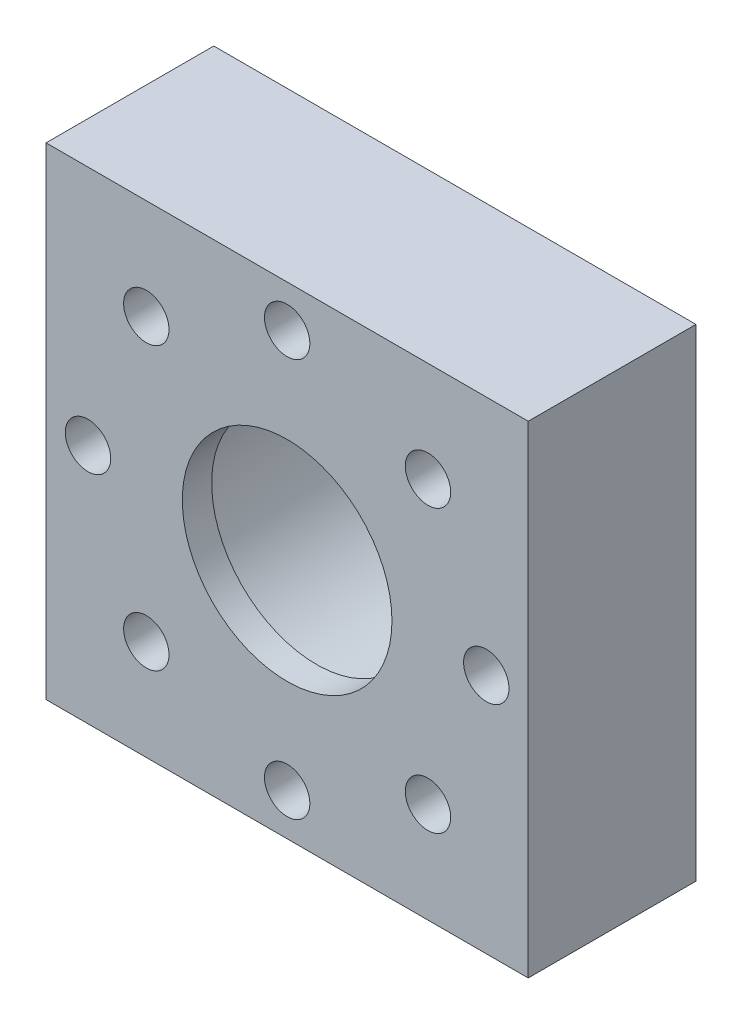
ISO-10303-21;
HEADER;
FILE_DESCRIPTION(('STEP AP214'),'2;1');
FILE_NAME('part.step','',(''),(''),'','','');
FILE_SCHEMA(('AUTOMOTIVE_DESIGN { 1 0 10303 214 1 1 1 1 }'));
ENDSEC;
DATA;
#1=APPLICATION_CONTEXT('core data for automotive mechanical design processes');
#2=APPLICATION_PROTOCOL_DEFINITION('international standard','automotive_design',2000,#1);
#3=PRODUCT_CONTEXT('',#1,'mechanical');
#4=PRODUCT('Part','Part','',(#3));
#5=PRODUCT_RELATED_PRODUCT_CATEGORY('part','',(#4));
#6=PRODUCT_DEFINITION_FORMATION('','',#4);
#7=PRODUCT_DEFINITION_CONTEXT('part definition',#1,'design');
#8=PRODUCT_DEFINITION('design','',#6,#7);
#9=PRODUCT_DEFINITION_SHAPE('','',#8);
#10=(LENGTH_UNIT() NAMED_UNIT(*) SI_UNIT(.MILLI.,.METRE.));
#11=(NAMED_UNIT(*) PLANE_ANGLE_UNIT() SI_UNIT($,.RADIAN.));
#12=(NAMED_UNIT(*) SI_UNIT($,.STERADIAN.) SOLID_ANGLE_UNIT());
#13=UNCERTAINTY_MEASURE_WITH_UNIT(LENGTH_MEASURE(1.E-05),#10,'distance_accuracy_value','');
#14=(GEOMETRIC_REPRESENTATION_CONTEXT(3) GLOBAL_UNCERTAINTY_ASSIGNED_CONTEXT((#13)) GLOBAL_UNIT_ASSIGNED_CONTEXT((#10,
#11,#12)) REPRESENTATION_CONTEXT('',''));
#15=CARTESIAN_POINT('',(0.,0.,0.));
#16=DIRECTION('',(0.,0.,1.));
#17=DIRECTION('',(1.,0.,0.));
#18=AXIS2_PLACEMENT_3D('',#15,#16,#17);
#19=CARTESIAN_POINT('',(-29.21,-29.21,20.32));
#20=DIRECTION('',(1.,0.,0.));
#21=DIRECTION('',(0.,1.,0.));
#22=AXIS2_PLACEMENT_3D('',#19,#20,#21);
#23=PLANE('',#22);
#24=DIRECTION('',(0.,-1.,0.));
#25=VECTOR('',#24,1.);
#26=CARTESIAN_POINT('',(-29.21,-29.21,0.));
#27=LINE('',#26,#25);
#28=CARTESIAN_POINT('',(-29.21,29.21,0.));
#29=VERTEX_POINT('',#28);
#30=CARTESIAN_POINT('',(-29.21,-29.21,0.));
#31=VERTEX_POINT('',#30);
#32=EDGE_CURVE('E111',#29,#31,#27,.T.);
#33=ORIENTED_EDGE('',*,*,#32,.T.);
#34=DIRECTION('',(0.,0.,-1.));
#35=VECTOR('',#34,1.);
#36=CARTESIAN_POINT('',(-29.21,-29.21,20.32));
#37=LINE('',#36,#35);
#38=CARTESIAN_POINT('',(-29.21,-29.21,20.32));
#39=VERTEX_POINT('',#38);
#40=EDGE_CURVE('E11',#39,#31,#37,.T.);
#41=ORIENTED_EDGE('',*,*,#40,.F.);
#42=DIRECTION('',(0.,-1.,0.));
#43=VECTOR('',#42,1.);
#44=CARTESIAN_POINT('',(-29.21,-29.21,20.32));
#45=LINE('',#44,#43);
#46=CARTESIAN_POINT('',(-29.21,29.21,20.32));
#47=VERTEX_POINT('',#46);
#48=EDGE_CURVE('E99',#47,#39,#45,.T.);
#49=ORIENTED_EDGE('',*,*,#48,.F.);
#50=DIRECTION('',(0.,0.,-1.));
#51=VECTOR('',#50,1.);
#52=CARTESIAN_POINT('',(-29.21,29.21,20.32));
#53=LINE('',#52,#51);
#54=EDGE_CURVE('E107',#47,#29,#53,.T.);
#55=ORIENTED_EDGE('',*,*,#54,.T.);
#56=EDGE_LOOP('',(#33,#41,#49,#55));
#57=FACE_BOUND('',#56,.T.);
#58=ADVANCED_FACE('F47',(#57),#23,.F.);
#59=CARTESIAN_POINT('',(-29.21,-29.21,20.32));
#60=DIRECTION('',(0.,1.,0.));
#61=DIRECTION('',(0.,0.,1.));
#62=AXIS2_PLACEMENT_3D('',#59,#60,#61);
#63=PLANE('',#62);
#64=DIRECTION('',(1.,0.,0.));
#65=VECTOR('',#64,1.);
#66=CARTESIAN_POINT('',(-29.21,-29.21,0.));
#67=LINE('',#66,#65);
#68=CARTESIAN_POINT('',(29.21,-29.21,0.));
#69=VERTEX_POINT('',#68);
#70=EDGE_CURVE('E103',#31,#69,#67,.T.);
#71=ORIENTED_EDGE('',*,*,#70,.T.);
#72=DIRECTION('',(0.,0.,-1.));
#73=VECTOR('',#72,1.);
#74=CARTESIAN_POINT('',(29.21,-29.21,20.32));
#75=LINE('',#74,#73);
#76=CARTESIAN_POINT('',(29.21,-29.21,20.32));
#77=VERTEX_POINT('',#76);
#78=EDGE_CURVE('E55',#77,#69,#75,.T.);
#79=ORIENTED_EDGE('',*,*,#78,.F.);
#80=DIRECTION('',(1.,0.,0.));
#81=VECTOR('',#80,1.);
#82=CARTESIAN_POINT('',(-29.21,-29.21,20.32));
#83=LINE('',#82,#81);
#84=EDGE_CURVE('E93',#39,#77,#83,.T.);
#85=ORIENTED_EDGE('',*,*,#84,.F.);
#86=ORIENTED_EDGE('',*,*,#40,.T.);
#87=EDGE_LOOP('',(#71,#79,#85,#86));
#88=FACE_BOUND('',#87,.T.);
#89=ADVANCED_FACE('F102',(#88),#63,.F.);
#90=CARTESIAN_POINT('',(29.21,-29.21,20.32));
#91=DIRECTION('',(-1.,0.,0.));
#92=DIRECTION('',(0.,-1.,0.));
#93=AXIS2_PLACEMENT_3D('',#90,#91,#92);
#94=PLANE('',#93);
#95=DIRECTION('',(0.,1.,0.));
#96=VECTOR('',#95,1.);
#97=CARTESIAN_POINT('',(29.21,-29.21,0.));
#98=LINE('',#97,#96);
#99=CARTESIAN_POINT('',(29.21,29.21,0.));
#100=VERTEX_POINT('',#99);
#101=EDGE_CURVE('E80',#69,#100,#98,.T.);
#102=ORIENTED_EDGE('',*,*,#101,.T.);
#103=DIRECTION('',(0.,0.,-1.));
#104=VECTOR('',#103,1.);
#105=CARTESIAN_POINT('',(29.21,29.21,20.32));
#106=LINE('',#105,#104);
#107=CARTESIAN_POINT('',(29.21,29.21,20.32));
#108=VERTEX_POINT('',#107);
#109=EDGE_CURVE('E104',#108,#100,#106,.T.);
#110=ORIENTED_EDGE('',*,*,#109,.F.);
#111=DIRECTION('',(0.,1.,0.));
#112=VECTOR('',#111,1.);
#113=CARTESIAN_POINT('',(29.21,-29.21,20.32));
#114=LINE('',#113,#112);
#115=EDGE_CURVE('E97',#77,#108,#114,.T.);
#116=ORIENTED_EDGE('',*,*,#115,.F.);
#117=ORIENTED_EDGE('',*,*,#78,.T.);
#118=EDGE_LOOP('',(#102,#110,#116,#117));
#119=FACE_BOUND('',#118,.T.);
#120=ADVANCED_FACE('F105',(#119),#94,.F.);
#121=CARTESIAN_POINT('',(-29.21,29.21,20.32));
#122=DIRECTION('',(0.,-1.,0.));
#123=DIRECTION('',(1.,0.,0.));
#124=AXIS2_PLACEMENT_3D('',#121,#122,#123);
#125=PLANE('',#124);
#126=DIRECTION('',(-1.,0.,0.));
#127=VECTOR('',#126,1.);
#128=CARTESIAN_POINT('',(-29.21,29.21,0.));
#129=LINE('',#128,#127);
#130=EDGE_CURVE('E86',#100,#29,#129,.T.);
#131=ORIENTED_EDGE('',*,*,#130,.T.);
#132=ORIENTED_EDGE('',*,*,#54,.F.);
#133=DIRECTION('',(-1.,0.,0.));
#134=VECTOR('',#133,1.);
#135=CARTESIAN_POINT('',(-29.21,29.21,20.32));
#136=LINE('',#135,#134);
#137=EDGE_CURVE('E63',#108,#47,#136,.T.);
#138=ORIENTED_EDGE('',*,*,#137,.F.);
#139=ORIENTED_EDGE('',*,*,#109,.T.);
#140=EDGE_LOOP('',(#131,#132,#138,#139));
#141=FACE_BOUND('',#140,.T.);
#142=ADVANCED_FACE('F119',(#141),#125,.F.);
#143=CARTESIAN_POINT('',(0.,0.,20.32));
#144=DIRECTION('',(0.,0.,-1.));
#145=DIRECTION('',(-1.,0.,0.));
#146=AXIS2_PLACEMENT_3D('',#143,#144,#145);
#147=PLANE('',#146);
#148=CARTESIAN_POINT('',(-17.0624866300312,17.0624866300316,20.32));
#149=DIRECTION('',(0.,0.,-1.));
#150=DIRECTION('',(-1.,0.,0.));
#151=AXIS2_PLACEMENT_3D('',#148,#149,#150);
#152=CIRCLE('',#151,2.75);
#153=CARTESIAN_POINT('',(-19.8124866300312,17.0624866300316,20.32));
#154=VERTEX_POINT('',#153);
#155=EDGE_CURVE('E172',#154,#154,#152,.T.);
#156=ORIENTED_EDGE('',*,*,#155,.T.);
#157=EDGE_LOOP('',(#156));
#158=FACE_BOUND('',#157,.T.);
#159=CARTESIAN_POINT('',(-24.13,2.52748334118854E-13,20.32));
#160=DIRECTION('',(0.,0.,-1.));
#161=DIRECTION('',(-1.,0.,0.));
#162=AXIS2_PLACEMENT_3D('',#159,#160,#161);
#163=CIRCLE('',#162,2.75);
#164=CARTESIAN_POINT('',(-26.88,2.52748334118854E-13,20.32));
#165=VERTEX_POINT('',#164);
#166=EDGE_CURVE('E166',#165,#165,#163,.T.);
#167=ORIENTED_EDGE('',*,*,#166,.T.);
#168=EDGE_LOOP('',(#167));
#169=FACE_BOUND('',#168,.T.);
#170=CARTESIAN_POINT('',(-17.0624866300315,-17.0624866300312,20.32));
#171=DIRECTION('',(0.,0.,-1.));
#172=DIRECTION('',(-1.,0.,0.));
#173=AXIS2_PLACEMENT_3D('',#170,#171,#172);
#174=CIRCLE('',#173,2.75);
#175=CARTESIAN_POINT('',(-19.8124866300315,-17.0624866300312,20.32));
#176=VERTEX_POINT('',#175);
#177=EDGE_CURVE('E160',#176,#176,#174,.T.);
#178=ORIENTED_EDGE('',*,*,#177,.T.);
#179=EDGE_LOOP('',(#178));
#180=FACE_BOUND('',#179,.T.);
#181=CARTESIAN_POINT('',(0.,-24.13,20.32));
#182=DIRECTION('',(0.,0.,-1.));
#183=DIRECTION('',(-1.,0.,0.));
#184=AXIS2_PLACEMENT_3D('',#181,#182,#183);
#185=CIRCLE('',#184,2.75);
#186=CARTESIAN_POINT('',(-2.75,-24.13,20.32));
#187=VERTEX_POINT('',#186);
#188=EDGE_CURVE('E154',#187,#187,#185,.T.);
#189=ORIENTED_EDGE('',*,*,#188,.T.);
#190=EDGE_LOOP('',(#189));
#191=FACE_BOUND('',#190,.T.);
#192=CARTESIAN_POINT('',(17.0624866300313,-17.0624866300315,20.32));
#193=DIRECTION('',(0.,0.,-1.));
#194=DIRECTION('',(-1.,0.,0.));
#195=AXIS2_PLACEMENT_3D('',#192,#193,#194);
#196=CIRCLE('',#195,2.75);
#197=CARTESIAN_POINT('',(14.3124866300313,-17.0624866300315,20.32));
#198=VERTEX_POINT('',#197);
#199=EDGE_CURVE('E148',#198,#198,#196,.T.);
#200=ORIENTED_EDGE('',*,*,#199,.T.);
#201=EDGE_LOOP('',(#200));
#202=FACE_BOUND('',#201,.T.);
#203=CARTESIAN_POINT('',(24.13,0.,20.32));
#204=DIRECTION('',(0.,0.,-1.));
#205=DIRECTION('',(-1.,0.,0.));
#206=AXIS2_PLACEMENT_3D('',#203,#204,#205);
#207=CIRCLE('',#206,2.75);
#208=CARTESIAN_POINT('',(21.38,0.,20.32));
#209=VERTEX_POINT('',#208);
#210=EDGE_CURVE('E142',#209,#209,#207,.T.);
#211=ORIENTED_EDGE('',*,*,#210,.T.);
#212=EDGE_LOOP('',(#211));
#213=FACE_BOUND('',#212,.T.);
#214=CARTESIAN_POINT('',(17.0624866300314,17.0624866300314,20.32));
#215=DIRECTION('',(0.,0.,-1.));
#216=DIRECTION('',(-1.,0.,0.));
#217=AXIS2_PLACEMENT_3D('',#214,#215,#216);
#218=CIRCLE('',#217,2.75);
#219=CARTESIAN_POINT('',(14.3124866300314,17.0624866300314,20.32));
#220=VERTEX_POINT('',#219);
#221=EDGE_CURVE('E136',#220,#220,#218,.T.);
#222=ORIENTED_EDGE('',*,*,#221,.T.);
#223=EDGE_LOOP('',(#222));
#224=FACE_BOUND('',#223,.T.);
#225=CARTESIAN_POINT('',(0.,24.13,20.32));
#226=DIRECTION('',(0.,0.,-1.));
#227=DIRECTION('',(-1.,0.,0.));
#228=AXIS2_PLACEMENT_3D('',#225,#226,#227);
#229=CIRCLE('',#228,2.75);
#230=CARTESIAN_POINT('',(-2.75,24.13,20.32));
#231=VERTEX_POINT('',#230);
#232=EDGE_CURVE('E130',#231,#231,#229,.T.);
#233=ORIENTED_EDGE('',*,*,#232,.T.);
#234=EDGE_LOOP('',(#233));
#235=FACE_BOUND('',#234,.T.);
#236=ORIENTED_EDGE('',*,*,#48,.T.);
#237=ORIENTED_EDGE('',*,*,#84,.T.);
#238=ORIENTED_EDGE('',*,*,#115,.T.);
#239=ORIENTED_EDGE('',*,*,#137,.T.);
#240=EDGE_LOOP('',(#236,#237,#238,#239));
#241=FACE_BOUND('',#240,.T.);
#242=CARTESIAN_POINT('',(0.,0.,20.32));
#243=DIRECTION('',(0.,0.,1.));
#244=DIRECTION('',(1.,0.,0.));
#245=AXIS2_PLACEMENT_3D('',#242,#243,#244);
#246=CIRCLE('',#245,12.7);
#247=CARTESIAN_POINT('',(12.7,0.,20.32));
#248=VERTEX_POINT('',#247);
#249=EDGE_CURVE('E181',#248,#248,#246,.T.);
#250=ORIENTED_EDGE('',*,*,#249,.F.);
#251=EDGE_LOOP('',(#250));
#252=FACE_BOUND('',#251,.T.);
#253=ADVANCED_FACE('F94',(#158,#169,#180,#191,#202,#213,#224,#235,#241,#252),#147,.F.);
#254=CARTESIAN_POINT('',(0.,0.,0.));
#255=DIRECTION('',(0.,0.,-1.));
#256=DIRECTION('',(-1.,0.,0.));
#257=AXIS2_PLACEMENT_3D('',#254,#255,#256);
#258=PLANE('',#257);
#259=CARTESIAN_POINT('',(-17.0624866300312,17.0624866300316,0.));
#260=DIRECTION('',(0.,0.,-1.));
#261=DIRECTION('',(-1.,0.,0.));
#262=AXIS2_PLACEMENT_3D('',#259,#260,#261);
#263=CIRCLE('',#262,2.75);
#264=CARTESIAN_POINT('',(-19.8124866300312,17.0624866300316,0.));
#265=VERTEX_POINT('',#264);
#266=EDGE_CURVE('E175',#265,#265,#263,.T.);
#267=ORIENTED_EDGE('',*,*,#266,.F.);
#268=EDGE_LOOP('',(#267));
#269=FACE_BOUND('',#268,.T.);
#270=CARTESIAN_POINT('',(-24.13,2.52748334118854E-13,0.));
#271=DIRECTION('',(0.,0.,-1.));
#272=DIRECTION('',(-1.,0.,0.));
#273=AXIS2_PLACEMENT_3D('',#270,#271,#272);
#274=CIRCLE('',#273,2.75);
#275=CARTESIAN_POINT('',(-26.88,2.52748334118854E-13,0.));
#276=VERTEX_POINT('',#275);
#277=EDGE_CURVE('E169',#276,#276,#274,.T.);
#278=ORIENTED_EDGE('',*,*,#277,.F.);
#279=EDGE_LOOP('',(#278));
#280=FACE_BOUND('',#279,.T.);
#281=CARTESIAN_POINT('',(-17.0624866300315,-17.0624866300312,0.));
#282=DIRECTION('',(0.,0.,-1.));
#283=DIRECTION('',(-1.,0.,0.));
#284=AXIS2_PLACEMENT_3D('',#281,#282,#283);
#285=CIRCLE('',#284,2.75);
#286=CARTESIAN_POINT('',(-19.8124866300315,-17.0624866300312,0.));
#287=VERTEX_POINT('',#286);
#288=EDGE_CURVE('E163',#287,#287,#285,.T.);
#289=ORIENTED_EDGE('',*,*,#288,.F.);
#290=EDGE_LOOP('',(#289));
#291=FACE_BOUND('',#290,.T.);
#292=CARTESIAN_POINT('',(0.,-24.13,0.));
#293=DIRECTION('',(0.,0.,-1.));
#294=DIRECTION('',(-1.,0.,0.));
#295=AXIS2_PLACEMENT_3D('',#292,#293,#294);
#296=CIRCLE('',#295,2.75);
#297=CARTESIAN_POINT('',(-2.75,-24.13,0.));
#298=VERTEX_POINT('',#297);
#299=EDGE_CURVE('E157',#298,#298,#296,.T.);
#300=ORIENTED_EDGE('',*,*,#299,.F.);
#301=EDGE_LOOP('',(#300));
#302=FACE_BOUND('',#301,.T.);
#303=CARTESIAN_POINT('',(17.0624866300313,-17.0624866300315,0.));
#304=DIRECTION('',(0.,0.,-1.));
#305=DIRECTION('',(-1.,0.,0.));
#306=AXIS2_PLACEMENT_3D('',#303,#304,#305);
#307=CIRCLE('',#306,2.75);
#308=CARTESIAN_POINT('',(14.3124866300313,-17.0624866300315,0.));
#309=VERTEX_POINT('',#308);
#310=EDGE_CURVE('E151',#309,#309,#307,.T.);
#311=ORIENTED_EDGE('',*,*,#310,.F.);
#312=EDGE_LOOP('',(#311));
#313=FACE_BOUND('',#312,.T.);
#314=CARTESIAN_POINT('',(24.13,0.,0.));
#315=DIRECTION('',(0.,0.,-1.));
#316=DIRECTION('',(-1.,0.,0.));
#317=AXIS2_PLACEMENT_3D('',#314,#315,#316);
#318=CIRCLE('',#317,2.75);
#319=CARTESIAN_POINT('',(21.38,0.,0.));
#320=VERTEX_POINT('',#319);
#321=EDGE_CURVE('E145',#320,#320,#318,.T.);
#322=ORIENTED_EDGE('',*,*,#321,.F.);
#323=EDGE_LOOP('',(#322));
#324=FACE_BOUND('',#323,.T.);
#325=CARTESIAN_POINT('',(17.0624866300314,17.0624866300314,0.));
#326=DIRECTION('',(0.,0.,-1.));
#327=DIRECTION('',(-1.,0.,0.));
#328=AXIS2_PLACEMENT_3D('',#325,#326,#327);
#329=CIRCLE('',#328,2.75);
#330=CARTESIAN_POINT('',(14.3124866300314,17.0624866300314,0.));
#331=VERTEX_POINT('',#330);
#332=EDGE_CURVE('E139',#331,#331,#329,.T.);
#333=ORIENTED_EDGE('',*,*,#332,.F.);
#334=EDGE_LOOP('',(#333));
#335=FACE_BOUND('',#334,.T.);
#336=CARTESIAN_POINT('',(0.,24.13,0.));
#337=DIRECTION('',(0.,0.,-1.));
#338=DIRECTION('',(-1.,0.,0.));
#339=AXIS2_PLACEMENT_3D('',#336,#337,#338);
#340=CIRCLE('',#339,2.75);
#341=CARTESIAN_POINT('',(-2.75,24.13,0.));
#342=VERTEX_POINT('',#341);
#343=EDGE_CURVE('E133',#342,#342,#340,.T.);
#344=ORIENTED_EDGE('',*,*,#343,.F.);
#345=EDGE_LOOP('',(#344));
#346=FACE_BOUND('',#345,.T.);
#347=CARTESIAN_POINT('',(0.,0.,0.));
#348=DIRECTION('',(0.,0.,-1.));
#349=DIRECTION('',(-1.,0.,0.));
#350=AXIS2_PLACEMENT_3D('',#347,#348,#349);
#351=CIRCLE('',#350,15.7299152);
#352=CARTESIAN_POINT('',(-15.7299152,0.,0.));
#353=VERTEX_POINT('',#352);
#354=EDGE_CURVE('E127',#353,#353,#351,.T.);
#355=ORIENTED_EDGE('',*,*,#354,.F.);
#356=EDGE_LOOP('',(#355));
#357=FACE_BOUND('',#356,.T.);
#358=ORIENTED_EDGE('',*,*,#32,.F.);
#359=ORIENTED_EDGE('',*,*,#130,.F.);
#360=ORIENTED_EDGE('',*,*,#101,.F.);
#361=ORIENTED_EDGE('',*,*,#70,.F.);
#362=EDGE_LOOP('',(#358,#359,#360,#361));
#363=FACE_BOUND('',#362,.T.);
#364=ADVANCED_FACE('F122',(#269,#280,#291,#302,#313,#324,#335,#346,#357,#363),#258,.T.);
#365=CARTESIAN_POINT('',(14.4907,0.,16.764));
#366=DIRECTION('',(0.,0.,1.));
#367=DIRECTION('',(1.,0.,0.));
#368=AXIS2_PLACEMENT_3D('',#365,#366,#367);
#369=PLANE('',#368);
#370=CARTESIAN_POINT('',(0.,0.,16.764));
#371=DIRECTION('',(0.,0.,-1.));
#372=DIRECTION('',(-1.,0.,0.));
#373=AXIS2_PLACEMENT_3D('',#370,#371,#372);
#374=CIRCLE('',#373,15.2279785901452);
#375=CARTESIAN_POINT('',(-15.2279785901452,0.,16.764));
#376=VERTEX_POINT('',#375);
#377=EDGE_CURVE('E114',#376,#376,#374,.T.);
#378=ORIENTED_EDGE('',*,*,#377,.T.);
#379=EDGE_LOOP('',(#378));
#380=FACE_BOUND('',#379,.T.);
#381=CARTESIAN_POINT('',(0.,0.,16.764));
#382=DIRECTION('',(0.,0.,1.));
#383=DIRECTION('',(1.,0.,0.));
#384=AXIS2_PLACEMENT_3D('',#381,#382,#383);
#385=CIRCLE('',#384,12.7);
#386=CARTESIAN_POINT('',(12.7,0.,16.764));
#387=VERTEX_POINT('',#386);
#388=EDGE_CURVE('E178',#387,#387,#385,.F.);
#389=ORIENTED_EDGE('',*,*,#388,.F.);
#390=EDGE_LOOP('',(#389));
#391=FACE_BOUND('',#390,.T.);
#392=ADVANCED_FACE('F194',(#380,#391),#369,.F.);
#393=CARTESIAN_POINT('',(0.,0.,0.));
#394=DIRECTION('',(0.,0.,-1.));
#395=DIRECTION('',(-1.,0.,0.));
#396=AXIS2_PLACEMENT_3D('',#393,#394,#395);
#397=CONICAL_SURFACE('',#396,15.7299152,0.0299323966717033);
#398=ORIENTED_EDGE('',*,*,#377,.F.);
#399=EDGE_LOOP('',(#398));
#400=FACE_BOUND('',#399,.T.);
#401=ORIENTED_EDGE('',*,*,#354,.T.);
#402=EDGE_LOOP('',(#401));
#403=FACE_BOUND('',#402,.T.);
#404=ADVANCED_FACE('F221',(#400,#403),#397,.F.);
#405=CARTESIAN_POINT('',(0.,24.13,0.));
#406=DIRECTION('',(0.,0.,-1.));
#407=DIRECTION('',(-1.,0.,0.));
#408=AXIS2_PLACEMENT_3D('',#405,#406,#407);
#409=CYLINDRICAL_SURFACE('',#408,2.75);
#410=ORIENTED_EDGE('',*,*,#232,.F.);
#411=EDGE_LOOP('',(#410));
#412=FACE_BOUND('',#411,.T.);
#413=ORIENTED_EDGE('',*,*,#343,.T.);
#414=EDGE_LOOP('',(#413));
#415=FACE_BOUND('',#414,.T.);
#416=ADVANCED_FACE('F227',(#412,#415),#409,.F.);
#417=CARTESIAN_POINT('',(17.0624866300314,17.0624866300314,0.));
#418=DIRECTION('',(0.,0.,-1.));
#419=DIRECTION('',(-1.,0.,0.));
#420=AXIS2_PLACEMENT_3D('',#417,#418,#419);
#421=CYLINDRICAL_SURFACE('',#420,2.75);
#422=ORIENTED_EDGE('',*,*,#221,.F.);
#423=EDGE_LOOP('',(#422));
#424=FACE_BOUND('',#423,.T.);
#425=ORIENTED_EDGE('',*,*,#332,.T.);
#426=EDGE_LOOP('',(#425));
#427=FACE_BOUND('',#426,.T.);
#428=ADVANCED_FACE('F238',(#424,#427),#421,.F.);
#429=CARTESIAN_POINT('',(24.13,0.,0.));
#430=DIRECTION('',(0.,0.,-1.));
#431=DIRECTION('',(-1.,0.,0.));
#432=AXIS2_PLACEMENT_3D('',#429,#430,#431);
#433=CYLINDRICAL_SURFACE('',#432,2.75);
#434=ORIENTED_EDGE('',*,*,#210,.F.);
#435=EDGE_LOOP('',(#434));
#436=FACE_BOUND('',#435,.T.);
#437=ORIENTED_EDGE('',*,*,#321,.T.);
#438=EDGE_LOOP('',(#437));
#439=FACE_BOUND('',#438,.T.);
#440=ADVANCED_FACE('F253',(#436,#439),#433,.F.);
#441=CARTESIAN_POINT('',(17.0624866300313,-17.0624866300315,0.));
#442=DIRECTION('',(0.,0.,-1.));
#443=DIRECTION('',(-1.,0.,0.));
#444=AXIS2_PLACEMENT_3D('',#441,#442,#443);
#445=CYLINDRICAL_SURFACE('',#444,2.75);
#446=ORIENTED_EDGE('',*,*,#199,.F.);
#447=EDGE_LOOP('',(#446));
#448=FACE_BOUND('',#447,.T.);
#449=ORIENTED_EDGE('',*,*,#310,.T.);
#450=EDGE_LOOP('',(#449));
#451=FACE_BOUND('',#450,.T.);
#452=ADVANCED_FACE('F262',(#448,#451),#445,.F.);
#453=CARTESIAN_POINT('',(0.,-24.13,0.));
#454=DIRECTION('',(0.,0.,-1.));
#455=DIRECTION('',(-1.,0.,0.));
#456=AXIS2_PLACEMENT_3D('',#453,#454,#455);
#457=CYLINDRICAL_SURFACE('',#456,2.75);
#458=ORIENTED_EDGE('',*,*,#188,.F.);
#459=EDGE_LOOP('',(#458));
#460=FACE_BOUND('',#459,.T.);
#461=ORIENTED_EDGE('',*,*,#299,.T.);
#462=EDGE_LOOP('',(#461));
#463=FACE_BOUND('',#462,.T.);
#464=ADVANCED_FACE('F271',(#460,#463),#457,.F.);
#465=CARTESIAN_POINT('',(-17.0624866300315,-17.0624866300312,0.));
#466=DIRECTION('',(0.,0.,-1.));
#467=DIRECTION('',(-1.,0.,0.));
#468=AXIS2_PLACEMENT_3D('',#465,#466,#467);
#469=CYLINDRICAL_SURFACE('',#468,2.75);
#470=ORIENTED_EDGE('',*,*,#177,.F.);
#471=EDGE_LOOP('',(#470));
#472=FACE_BOUND('',#471,.T.);
#473=ORIENTED_EDGE('',*,*,#288,.T.);
#474=EDGE_LOOP('',(#473));
#475=FACE_BOUND('',#474,.T.);
#476=ADVANCED_FACE('F280',(#472,#475),#469,.F.);
#477=CARTESIAN_POINT('',(-24.13,2.52748334118854E-13,0.));
#478=DIRECTION('',(0.,0.,-1.));
#479=DIRECTION('',(-1.,0.,0.));
#480=AXIS2_PLACEMENT_3D('',#477,#478,#479);
#481=CYLINDRICAL_SURFACE('',#480,2.75);
#482=ORIENTED_EDGE('',*,*,#166,.F.);
#483=EDGE_LOOP('',(#482));
#484=FACE_BOUND('',#483,.T.);
#485=ORIENTED_EDGE('',*,*,#277,.T.);
#486=EDGE_LOOP('',(#485));
#487=FACE_BOUND('',#486,.T.);
#488=ADVANCED_FACE('F289',(#484,#487),#481,.F.);
#489=CARTESIAN_POINT('',(-17.0624866300312,17.0624866300316,0.));
#490=DIRECTION('',(0.,0.,-1.));
#491=DIRECTION('',(-1.,0.,0.));
#492=AXIS2_PLACEMENT_3D('',#489,#490,#491);
#493=CYLINDRICAL_SURFACE('',#492,2.75);
#494=ORIENTED_EDGE('',*,*,#155,.F.);
#495=EDGE_LOOP('',(#494));
#496=FACE_BOUND('',#495,.T.);
#497=ORIENTED_EDGE('',*,*,#266,.T.);
#498=EDGE_LOOP('',(#497));
#499=FACE_BOUND('',#498,.T.);
#500=ADVANCED_FACE('F297',(#496,#499),#493,.F.);
#501=CARTESIAN_POINT('',(0.,0.,-24.2218889365596));
#502=DIRECTION('',(0.,0.,1.));
#503=DIRECTION('',(1.,0.,0.));
#504=AXIS2_PLACEMENT_3D('',#501,#502,#503);
#505=CYLINDRICAL_SURFACE('',#504,12.7);
#506=ORIENTED_EDGE('',*,*,#388,.T.);
#507=EDGE_LOOP('',(#506));
#508=FACE_BOUND('',#507,.T.);
#509=ORIENTED_EDGE('',*,*,#249,.T.);
#510=EDGE_LOOP('',(#509));
#511=FACE_BOUND('',#510,.T.);
#512=ADVANCED_FACE('F185',(#508,#511),#505,.F.);
#513=CLOSED_SHELL('',(#58,#89,#120,#142,#253,#364,#392,#404,#416,#428,#440,#452,#464,#476,#488,
#500,#512));
#514=MANIFOLD_SOLID_BREP('B2',#513);
#515=ADVANCED_BREP_SHAPE_REPRESENTATION('',(#18,#514),#14);
#516=SHAPE_DEFINITION_REPRESENTATION(#9,#515);
ENDSEC;
END-ISO-10303-21;
